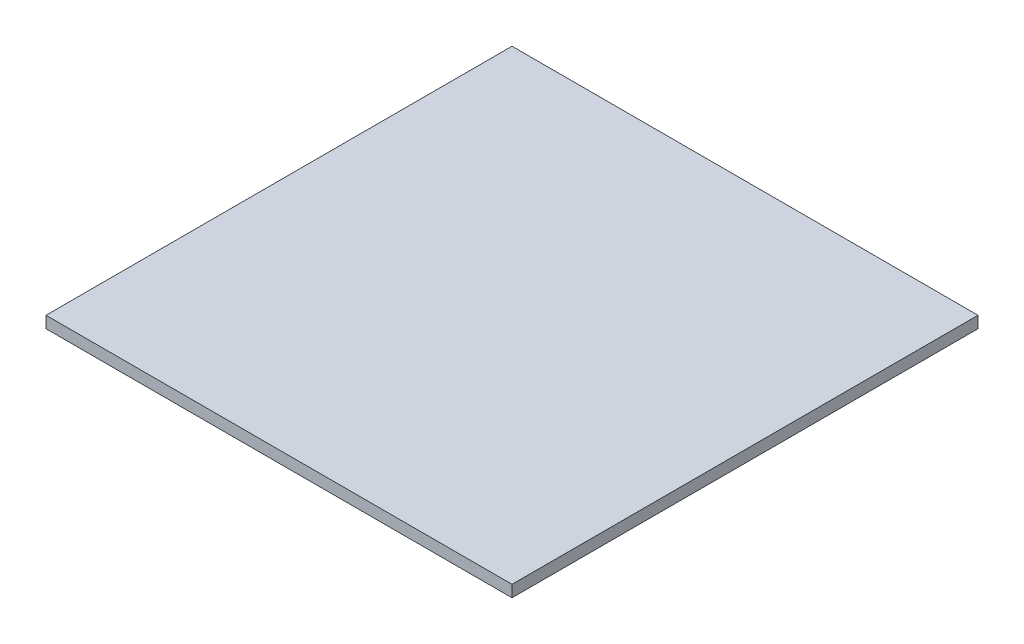
ISO-10303-21;
HEADER;
FILE_DESCRIPTION(('STEP AP214'),'2;1');
FILE_NAME('part.step','',(''),(''),'','','');
FILE_SCHEMA(('AUTOMOTIVE_DESIGN { 1 0 10303 214 1 1 1 1 }'));
ENDSEC;
DATA;
#1=APPLICATION_CONTEXT('core data for automotive mechanical design processes');
#2=APPLICATION_PROTOCOL_DEFINITION('international standard','automotive_design',2000,#1);
#3=PRODUCT_CONTEXT('',#1,'mechanical');
#4=PRODUCT('Part','Part','',(#3));
#5=PRODUCT_RELATED_PRODUCT_CATEGORY('part','',(#4));
#6=PRODUCT_DEFINITION_FORMATION('','',#4);
#7=PRODUCT_DEFINITION_CONTEXT('part definition',#1,'design');
#8=PRODUCT_DEFINITION('design','',#6,#7);
#9=PRODUCT_DEFINITION_SHAPE('','',#8);
#10=(LENGTH_UNIT() NAMED_UNIT(*) SI_UNIT(.MILLI.,.METRE.));
#11=(NAMED_UNIT(*) PLANE_ANGLE_UNIT() SI_UNIT($,.RADIAN.));
#12=(NAMED_UNIT(*) SI_UNIT($,.STERADIAN.) SOLID_ANGLE_UNIT());
#13=UNCERTAINTY_MEASURE_WITH_UNIT(LENGTH_MEASURE(1.E-05),#10,'distance_accuracy_value','');
#14=(GEOMETRIC_REPRESENTATION_CONTEXT(3) GLOBAL_UNCERTAINTY_ASSIGNED_CONTEXT((#13)) GLOBAL_UNIT_ASSIGNED_CONTEXT((#10,
#11,#12)) REPRESENTATION_CONTEXT('',''));
#15=CARTESIAN_POINT('',(0.,0.,0.));
#16=DIRECTION('',(0.,0.,1.));
#17=DIRECTION('',(1.,0.,0.));
#18=AXIS2_PLACEMENT_3D('',#15,#16,#17);
#19=CARTESIAN_POINT('',(228.6,11.4554,228.6));
#20=DIRECTION('',(-1.,0.,0.));
#21=DIRECTION('',(0.,0.,1.));
#22=AXIS2_PLACEMENT_3D('',#19,#20,#21);
#23=PLANE('',#22);
#24=DIRECTION('',(0.,0.,-1.));
#25=VECTOR('',#24,1.);
#26=CARTESIAN_POINT('',(228.6,0.,228.6));
#27=LINE('',#26,#25);
#28=CARTESIAN_POINT('',(228.6,0.,228.6));
#29=VERTEX_POINT('',#28);
#30=CARTESIAN_POINT('',(228.6,0.,-228.6));
#31=VERTEX_POINT('',#30);
#32=EDGE_CURVE('E95',#29,#31,#27,.T.);
#33=ORIENTED_EDGE('',*,*,#32,.T.);
#34=DIRECTION('',(0.,-1.,0.));
#35=VECTOR('',#34,1.);
#36=CARTESIAN_POINT('',(228.6,11.4554,-228.6));
#37=LINE('',#36,#35);
#38=CARTESIAN_POINT('',(228.6,11.4554,-228.6));
#39=VERTEX_POINT('',#38);
#40=EDGE_CURVE('E11',#39,#31,#37,.T.);
#41=ORIENTED_EDGE('',*,*,#40,.F.);
#42=DIRECTION('',(0.,0.,-1.));
#43=VECTOR('',#42,1.);
#44=CARTESIAN_POINT('',(228.6,11.4554,228.6));
#45=LINE('',#44,#43);
#46=CARTESIAN_POINT('',(228.6,11.4554,228.6));
#47=VERTEX_POINT('',#46);
#48=EDGE_CURVE('E83',#47,#39,#45,.T.);
#49=ORIENTED_EDGE('',*,*,#48,.F.);
#50=DIRECTION('',(0.,-1.,0.));
#51=VECTOR('',#50,1.);
#52=CARTESIAN_POINT('',(228.6,11.4554,228.6));
#53=LINE('',#52,#51);
#54=EDGE_CURVE('E91',#47,#29,#53,.T.);
#55=ORIENTED_EDGE('',*,*,#54,.T.);
#56=EDGE_LOOP('',(#33,#41,#49,#55));
#57=FACE_BOUND('',#56,.T.);
#58=ADVANCED_FACE('F32',(#57),#23,.F.);
#59=CARTESIAN_POINT('',(-228.6,11.4554,-228.6));
#60=DIRECTION('',(0.,0.,1.));
#61=DIRECTION('',(1.,0.,0.));
#62=AXIS2_PLACEMENT_3D('',#59,#60,#61);
#63=PLANE('',#62);
#64=DIRECTION('',(-1.,0.,0.));
#65=VECTOR('',#64,1.);
#66=CARTESIAN_POINT('',(-228.6,0.,-228.6));
#67=LINE('',#66,#65);
#68=CARTESIAN_POINT('',(-228.6,0.,-228.6));
#69=VERTEX_POINT('',#68);
#70=EDGE_CURVE('E87',#31,#69,#67,.T.);
#71=ORIENTED_EDGE('',*,*,#70,.T.);
#72=DIRECTION('',(0.,-1.,0.));
#73=VECTOR('',#72,1.);
#74=CARTESIAN_POINT('',(-228.6,11.4554,-228.6));
#75=LINE('',#74,#73);
#76=CARTESIAN_POINT('',(-228.6,11.4554,-228.6));
#77=VERTEX_POINT('',#76);
#78=EDGE_CURVE('E40',#77,#69,#75,.T.);
#79=ORIENTED_EDGE('',*,*,#78,.F.);
#80=DIRECTION('',(-1.,0.,0.));
#81=VECTOR('',#80,1.);
#82=CARTESIAN_POINT('',(-228.6,11.4554,-228.6));
#83=LINE('',#82,#81);
#84=EDGE_CURVE('E78',#39,#77,#83,.T.);
#85=ORIENTED_EDGE('',*,*,#84,.F.);
#86=ORIENTED_EDGE('',*,*,#40,.T.);
#87=EDGE_LOOP('',(#71,#79,#85,#86));
#88=FACE_BOUND('',#87,.T.);
#89=ADVANCED_FACE('F86',(#88),#63,.F.);
#90=CARTESIAN_POINT('',(-228.6,11.4554,228.6));
#91=DIRECTION('',(1.,0.,0.));
#92=DIRECTION('',(0.,0.,-1.));
#93=AXIS2_PLACEMENT_3D('',#90,#91,#92);
#94=PLANE('',#93);
#95=DIRECTION('',(0.,0.,1.));
#96=VECTOR('',#95,1.);
#97=CARTESIAN_POINT('',(-228.6,0.,228.6));
#98=LINE('',#97,#96);
#99=CARTESIAN_POINT('',(-228.6,0.,228.6));
#100=VERTEX_POINT('',#99);
#101=EDGE_CURVE('E65',#69,#100,#98,.T.);
#102=ORIENTED_EDGE('',*,*,#101,.T.);
#103=DIRECTION('',(0.,-1.,0.));
#104=VECTOR('',#103,1.);
#105=CARTESIAN_POINT('',(-228.6,11.4554,228.6));
#106=LINE('',#105,#104);
#107=CARTESIAN_POINT('',(-228.6,11.4554,228.6));
#108=VERTEX_POINT('',#107);
#109=EDGE_CURVE('E88',#108,#100,#106,.T.);
#110=ORIENTED_EDGE('',*,*,#109,.F.);
#111=DIRECTION('',(0.,0.,1.));
#112=VECTOR('',#111,1.);
#113=CARTESIAN_POINT('',(-228.6,11.4554,228.6));
#114=LINE('',#113,#112);
#115=EDGE_CURVE('E81',#77,#108,#114,.T.);
#116=ORIENTED_EDGE('',*,*,#115,.F.);
#117=ORIENTED_EDGE('',*,*,#78,.T.);
#118=EDGE_LOOP('',(#102,#110,#116,#117));
#119=FACE_BOUND('',#118,.T.);
#120=ADVANCED_FACE('F89',(#119),#94,.F.);
#121=CARTESIAN_POINT('',(-228.6,11.4554,228.6));
#122=DIRECTION('',(0.,0.,-1.));
#123=DIRECTION('',(-1.,0.,0.));
#124=AXIS2_PLACEMENT_3D('',#121,#122,#123);
#125=PLANE('',#124);
#126=DIRECTION('',(1.,0.,0.));
#127=VECTOR('',#126,1.);
#128=CARTESIAN_POINT('',(-228.6,0.,228.6));
#129=LINE('',#128,#127);
#130=EDGE_CURVE('E71',#100,#29,#129,.T.);
#131=ORIENTED_EDGE('',*,*,#130,.T.);
#132=ORIENTED_EDGE('',*,*,#54,.F.);
#133=DIRECTION('',(1.,0.,0.));
#134=VECTOR('',#133,1.);
#135=CARTESIAN_POINT('',(-228.6,11.4554,228.6));
#136=LINE('',#135,#134);
#137=EDGE_CURVE('E48',#108,#47,#136,.T.);
#138=ORIENTED_EDGE('',*,*,#137,.F.);
#139=ORIENTED_EDGE('',*,*,#109,.T.);
#140=EDGE_LOOP('',(#131,#132,#138,#139));
#141=FACE_BOUND('',#140,.T.);
#142=ADVANCED_FACE('F102',(#141),#125,.F.);
#143=CARTESIAN_POINT('',(0.,11.4554,0.));
#144=DIRECTION('',(0.,-1.,0.));
#145=DIRECTION('',(0.,0.,-1.));
#146=AXIS2_PLACEMENT_3D('',#143,#144,#145);
#147=PLANE('',#146);
#148=ORIENTED_EDGE('',*,*,#48,.T.);
#149=ORIENTED_EDGE('',*,*,#84,.T.);
#150=ORIENTED_EDGE('',*,*,#115,.T.);
#151=ORIENTED_EDGE('',*,*,#137,.T.);
#152=EDGE_LOOP('',(#148,#149,#150,#151));
#153=FACE_BOUND('',#152,.T.);
#154=ADVANCED_FACE('F79',(#153),#147,.F.);
#155=CARTESIAN_POINT('',(0.,0.,0.));
#156=DIRECTION('',(0.,-1.,0.));
#157=DIRECTION('',(0.,0.,-1.));
#158=AXIS2_PLACEMENT_3D('',#155,#156,#157);
#159=PLANE('',#158);
#160=ORIENTED_EDGE('',*,*,#32,.F.);
#161=ORIENTED_EDGE('',*,*,#130,.F.);
#162=ORIENTED_EDGE('',*,*,#101,.F.);
#163=ORIENTED_EDGE('',*,*,#70,.F.);
#164=EDGE_LOOP('',(#160,#161,#162,#163));
#165=FACE_BOUND('',#164,.T.);
#166=ADVANCED_FACE('F105',(#165),#159,.T.);
#167=CLOSED_SHELL('',(#58,#89,#120,#142,#154,#166));
#168=MANIFOLD_SOLID_BREP('B2',#167);
#169=ADVANCED_BREP_SHAPE_REPRESENTATION('',(#18,#168),#14);
#170=SHAPE_DEFINITION_REPRESENTATION(#9,#169);
ENDSEC;
END-ISO-10303-21;
